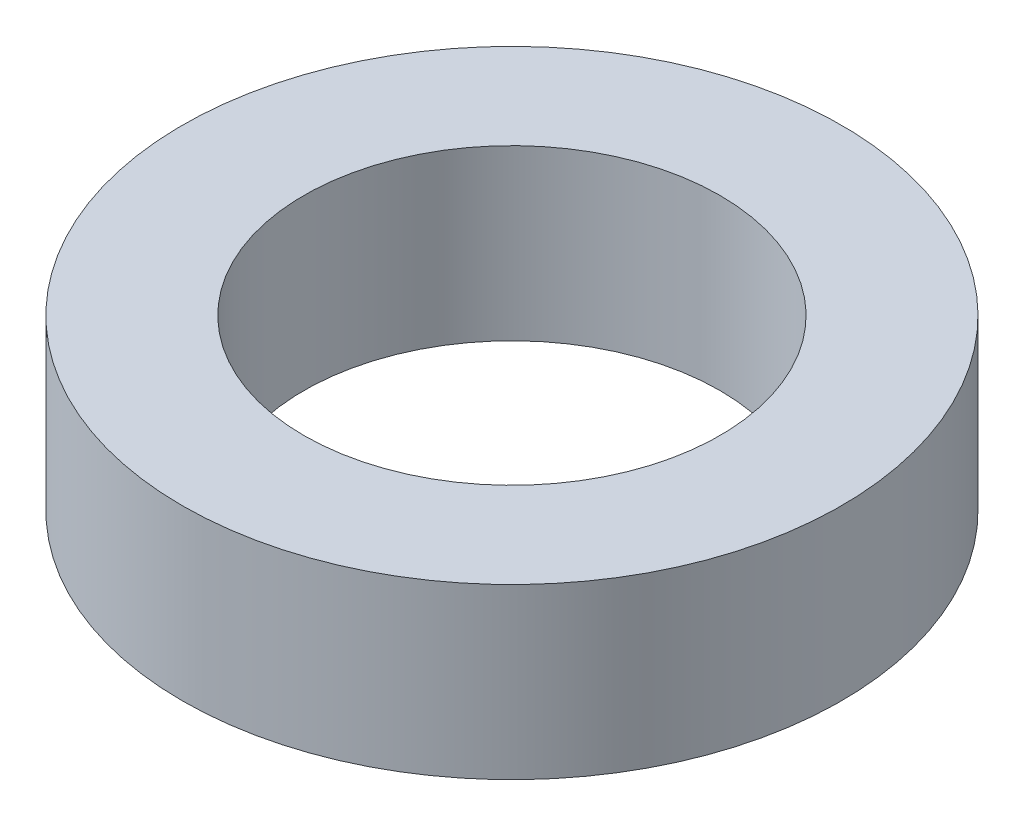
ISO-10303-21;
HEADER;
FILE_DESCRIPTION(('STEP AP214'),'2;1');
FILE_NAME('part.step','',(''),(''),'','','');
FILE_SCHEMA(('AUTOMOTIVE_DESIGN { 1 0 10303 214 1 1 1 1 }'));
ENDSEC;
DATA;
#1=APPLICATION_CONTEXT('core data for automotive mechanical design processes');
#2=APPLICATION_PROTOCOL_DEFINITION('international standard','automotive_design',2000,#1);
#3=PRODUCT_CONTEXT('',#1,'mechanical');
#4=PRODUCT('Part','Part','',(#3));
#5=PRODUCT_RELATED_PRODUCT_CATEGORY('part','',(#4));
#6=PRODUCT_DEFINITION_FORMATION('','',#4);
#7=PRODUCT_DEFINITION_CONTEXT('part definition',#1,'design');
#8=PRODUCT_DEFINITION('design','',#6,#7);
#9=PRODUCT_DEFINITION_SHAPE('','',#8);
#10=(LENGTH_UNIT() NAMED_UNIT(*) SI_UNIT(.MILLI.,.METRE.));
#11=(NAMED_UNIT(*) PLANE_ANGLE_UNIT() SI_UNIT($,.RADIAN.));
#12=(NAMED_UNIT(*) SI_UNIT($,.STERADIAN.) SOLID_ANGLE_UNIT());
#13=UNCERTAINTY_MEASURE_WITH_UNIT(LENGTH_MEASURE(1.E-05),#10,'distance_accuracy_value','');
#14=(GEOMETRIC_REPRESENTATION_CONTEXT(3) GLOBAL_UNCERTAINTY_ASSIGNED_CONTEXT((#13)) GLOBAL_UNIT_ASSIGNED_CONTEXT((#10,
#11,#12)) REPRESENTATION_CONTEXT('',''));
#15=CARTESIAN_POINT('',(0.,0.,0.));
#16=DIRECTION('',(0.,0.,1.));
#17=DIRECTION('',(1.,0.,0.));
#18=AXIS2_PLACEMENT_3D('',#15,#16,#17);
#19=CARTESIAN_POINT('',(0.,13.,0.));
#20=DIRECTION('',(0.,1.,0.));
#21=DIRECTION('',(0.,0.,1.));
#22=AXIS2_PLACEMENT_3D('',#19,#20,#21);
#23=PLANE('',#22);
#24=CARTESIAN_POINT('',(0.,13.,0.));
#25=DIRECTION('',(0.,1.,0.));
#26=DIRECTION('',(0.,0.,1.));
#27=AXIS2_PLACEMENT_3D('',#24,#25,#26);
#28=CIRCLE('',#27,25.35);
#29=CARTESIAN_POINT('',(0.,13.,25.35));
#30=VERTEX_POINT('',#29);
#31=EDGE_CURVE('E10',#30,#30,#28,.T.);
#32=ORIENTED_EDGE('',*,*,#31,.T.);
#33=EDGE_LOOP('',(#32));
#34=FACE_BOUND('',#33,.T.);
#35=CARTESIAN_POINT('',(0.,13.,0.));
#36=DIRECTION('',(0.,1.,0.));
#37=DIRECTION('',(0.,0.,1.));
#38=AXIS2_PLACEMENT_3D('',#35,#36,#37);
#39=CIRCLE('',#38,16.);
#40=CARTESIAN_POINT('',(0.,13.,16.));
#41=VERTEX_POINT('',#40);
#42=EDGE_CURVE('E50',#41,#41,#39,.T.);
#43=ORIENTED_EDGE('',*,*,#42,.F.);
#44=EDGE_LOOP('',(#43));
#45=FACE_BOUND('',#44,.T.);
#46=ADVANCED_FACE('F37',(#34,#45),#23,.T.);
#47=CARTESIAN_POINT('',(0.,0.,0.));
#48=DIRECTION('',(0.,1.,0.));
#49=DIRECTION('',(0.,0.,1.));
#50=AXIS2_PLACEMENT_3D('',#47,#48,#49);
#51=PLANE('',#50);
#52=CARTESIAN_POINT('',(0.,0.,0.));
#53=DIRECTION('',(0.,1.,0.));
#54=DIRECTION('',(0.,0.,1.));
#55=AXIS2_PLACEMENT_3D('',#52,#53,#54);
#56=CIRCLE('',#55,25.35);
#57=CARTESIAN_POINT('',(0.,0.,25.35));
#58=VERTEX_POINT('',#57);
#59=EDGE_CURVE('E41',#58,#58,#56,.T.);
#60=ORIENTED_EDGE('',*,*,#59,.F.);
#61=EDGE_LOOP('',(#60));
#62=FACE_BOUND('',#61,.T.);
#63=CARTESIAN_POINT('',(0.,0.,0.));
#64=DIRECTION('',(0.,1.,0.));
#65=DIRECTION('',(0.,0.,1.));
#66=AXIS2_PLACEMENT_3D('',#63,#64,#65);
#67=CIRCLE('',#66,16.);
#68=CARTESIAN_POINT('',(0.,0.,16.));
#69=VERTEX_POINT('',#68);
#70=EDGE_CURVE('E52',#69,#69,#67,.T.);
#71=ORIENTED_EDGE('',*,*,#70,.T.);
#72=EDGE_LOOP('',(#71));
#73=FACE_BOUND('',#72,.T.);
#74=ADVANCED_FACE('F64',(#62,#73),#51,.F.);
#75=CARTESIAN_POINT('',(0.,13.,0.));
#76=DIRECTION('',(0.,-1.,0.));
#77=DIRECTION('',(0.,0.,-1.));
#78=AXIS2_PLACEMENT_3D('',#75,#76,#77);
#79=CYLINDRICAL_SURFACE('',#78,25.35);
#80=ORIENTED_EDGE('',*,*,#31,.F.);
#81=EDGE_LOOP('',(#80));
#82=FACE_BOUND('',#81,.T.);
#83=ORIENTED_EDGE('',*,*,#59,.T.);
#84=EDGE_LOOP('',(#83));
#85=FACE_BOUND('',#84,.T.);
#86=ADVANCED_FACE('F39',(#82,#85),#79,.T.);
#87=CARTESIAN_POINT('',(0.,13.,0.));
#88=DIRECTION('',(0.,-1.,0.));
#89=DIRECTION('',(0.,0.,-1.));
#90=AXIS2_PLACEMENT_3D('',#87,#88,#89);
#91=CYLINDRICAL_SURFACE('',#90,16.);
#92=ORIENTED_EDGE('',*,*,#42,.T.);
#93=EDGE_LOOP('',(#92));
#94=FACE_BOUND('',#93,.T.);
#95=ORIENTED_EDGE('',*,*,#70,.F.);
#96=EDGE_LOOP('',(#95));
#97=FACE_BOUND('',#96,.T.);
#98=ADVANCED_FACE('F60',(#94,#97),#91,.F.);
#99=CLOSED_SHELL('',(#46,#74,#86,#98));
#100=MANIFOLD_SOLID_BREP('B2',#99);
#101=ADVANCED_BREP_SHAPE_REPRESENTATION('',(#18,#100),#14);
#102=SHAPE_DEFINITION_REPRESENTATION(#9,#101);
ENDSEC;
END-ISO-10303-21;
